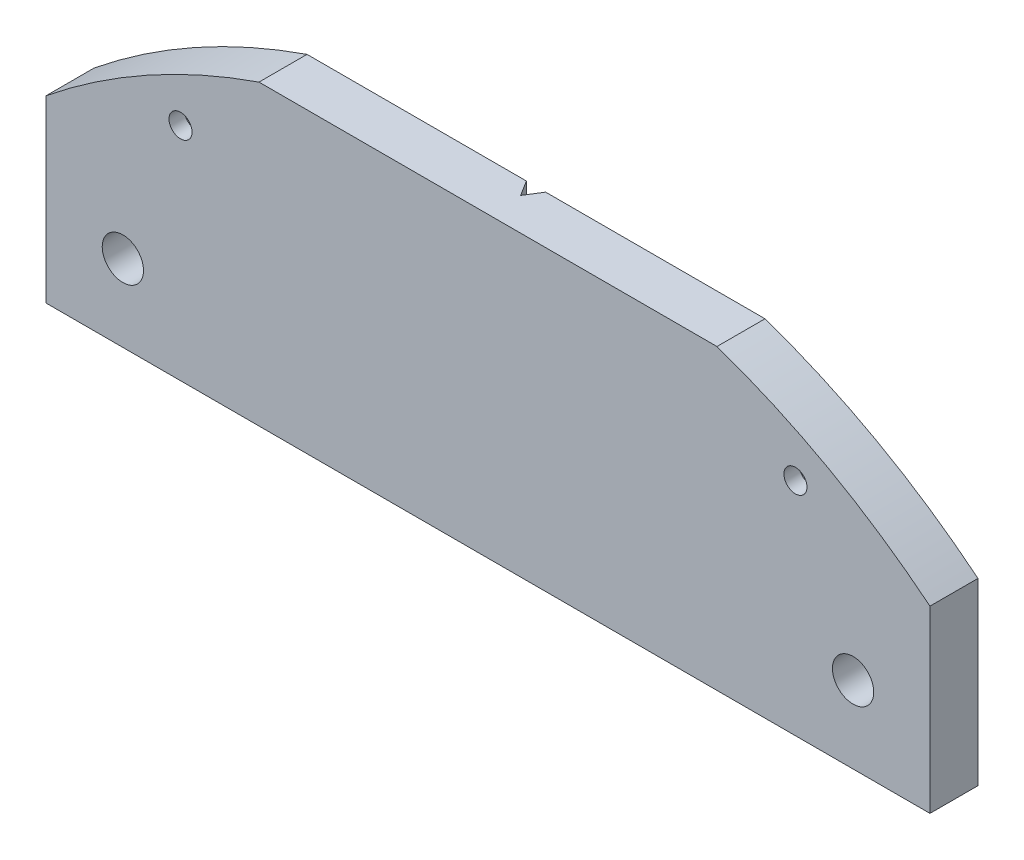
ISO-10303-21;
HEADER;
FILE_DESCRIPTION(('STEP AP214'),'2;1');
FILE_NAME('part.step','',(''),(''),'','','');
FILE_SCHEMA(('AUTOMOTIVE_DESIGN { 1 0 10303 214 1 1 1 1 }'));
ENDSEC;
DATA;
#1=APPLICATION_CONTEXT('core data for automotive mechanical design processes');
#2=APPLICATION_PROTOCOL_DEFINITION('international standard','automotive_design',2000,#1);
#3=PRODUCT_CONTEXT('',#1,'mechanical');
#4=PRODUCT('Part','Part','',(#3));
#5=PRODUCT_RELATED_PRODUCT_CATEGORY('part','',(#4));
#6=PRODUCT_DEFINITION_FORMATION('','',#4);
#7=PRODUCT_DEFINITION_CONTEXT('part definition',#1,'design');
#8=PRODUCT_DEFINITION('design','',#6,#7);
#9=PRODUCT_DEFINITION_SHAPE('','',#8);
#10=(LENGTH_UNIT() NAMED_UNIT(*) SI_UNIT(.MILLI.,.METRE.));
#11=(NAMED_UNIT(*) PLANE_ANGLE_UNIT() SI_UNIT($,.RADIAN.));
#12=(NAMED_UNIT(*) SI_UNIT($,.STERADIAN.) SOLID_ANGLE_UNIT());
#13=UNCERTAINTY_MEASURE_WITH_UNIT(LENGTH_MEASURE(1.E-05),#10,'distance_accuracy_value','');
#14=(GEOMETRIC_REPRESENTATION_CONTEXT(3) GLOBAL_UNCERTAINTY_ASSIGNED_CONTEXT((#13)) GLOBAL_UNIT_ASSIGNED_CONTEXT((#10,
#11,#12)) REPRESENTATION_CONTEXT('',''));
#15=CARTESIAN_POINT('',(0.,0.,0.));
#16=DIRECTION('',(0.,0.,1.));
#17=DIRECTION('',(1.,0.,0.));
#18=AXIS2_PLACEMENT_3D('',#15,#16,#17);
#19=CARTESIAN_POINT('',(32.,7.50000000000001,0.));
#20=DIRECTION('',(0.,0.,1.));
#21=DIRECTION('',(1.,0.,0.));
#22=AXIS2_PLACEMENT_3D('',#19,#20,#21);
#23=CYLINDRICAL_SURFACE('',#22,1.2);
#24=CARTESIAN_POINT('',(32.,7.50000000000001,5.));
#25=DIRECTION('',(0.,0.,1.));
#26=DIRECTION('',(1.,0.,0.));
#27=AXIS2_PLACEMENT_3D('',#24,#25,#26);
#28=CIRCLE('',#27,1.2);
#29=CARTESIAN_POINT('',(33.2,7.50000000000001,5.));
#30=VERTEX_POINT('',#29);
#31=EDGE_CURVE('E152',#30,#30,#28,.T.);
#32=ORIENTED_EDGE('',*,*,#31,.T.);
#33=EDGE_LOOP('',(#32));
#34=FACE_BOUND('',#33,.T.);
#35=CARTESIAN_POINT('',(32.,7.50000000000001,3.4));
#36=DIRECTION('',(0.,0.,-1.));
#37=DIRECTION('',(-1.,0.,0.));
#38=AXIS2_PLACEMENT_3D('',#35,#36,#37);
#39=CIRCLE('',#38,1.2);
#40=CARTESIAN_POINT('',(30.8,7.50000000000001,3.4));
#41=VERTEX_POINT('',#40);
#42=EDGE_CURVE('E43',#41,#41,#39,.F.);
#43=ORIENTED_EDGE('',*,*,#42,.F.);
#44=EDGE_LOOP('',(#43));
#45=FACE_BOUND('',#44,.T.);
#46=ADVANCED_FACE('F39',(#34,#45),#23,.F.);
#47=CARTESIAN_POINT('',(-32.,7.50000000000001,0.));
#48=DIRECTION('',(0.,0.,1.));
#49=DIRECTION('',(1.,0.,0.));
#50=AXIS2_PLACEMENT_3D('',#47,#48,#49);
#51=CYLINDRICAL_SURFACE('',#50,1.2);
#52=CARTESIAN_POINT('',(-32.,7.50000000000001,5.));
#53=DIRECTION('',(0.,0.,1.));
#54=DIRECTION('',(1.,0.,0.));
#55=AXIS2_PLACEMENT_3D('',#52,#53,#54);
#56=CIRCLE('',#55,1.2);
#57=CARTESIAN_POINT('',(-30.8,7.50000000000001,5.));
#58=VERTEX_POINT('',#57);
#59=EDGE_CURVE('E167',#58,#58,#56,.T.);
#60=ORIENTED_EDGE('',*,*,#59,.T.);
#61=EDGE_LOOP('',(#60));
#62=FACE_BOUND('',#61,.T.);
#63=CARTESIAN_POINT('',(-32.,7.50000000000001,3.4));
#64=DIRECTION('',(0.,0.,-1.));
#65=DIRECTION('',(-1.,0.,0.));
#66=AXIS2_PLACEMENT_3D('',#63,#64,#65);
#67=CIRCLE('',#66,1.2);
#68=CARTESIAN_POINT('',(-33.2,7.50000000000001,3.4));
#69=VERTEX_POINT('',#68);
#70=EDGE_CURVE('E146',#69,#69,#67,.F.);
#71=ORIENTED_EDGE('',*,*,#70,.F.);
#72=EDGE_LOOP('',(#71));
#73=FACE_BOUND('',#72,.T.);
#74=ADVANCED_FACE('F260',(#62,#73),#51,.F.);
#75=CARTESIAN_POINT('',(0.,0.,0.));
#76=DIRECTION('',(0.,0.,1.));
#77=DIRECTION('',(1.,0.,0.));
#78=AXIS2_PLACEMENT_3D('',#75,#76,#77);
#79=PLANE('',#78);
#80=CARTESIAN_POINT('',(-32.,7.50000000000001,0.));
#81=DIRECTION('',(0.,0.,-1.));
#82=DIRECTION('',(-1.,0.,0.));
#83=AXIS2_PLACEMENT_3D('',#80,#81,#82);
#84=CIRCLE('',#83,2.1);
#85=CARTESIAN_POINT('',(-34.1,7.50000000000001,0.));
#86=VERTEX_POINT('',#85);
#87=EDGE_CURVE('E159',#86,#86,#84,.T.);
#88=ORIENTED_EDGE('',*,*,#87,.F.);
#89=EDGE_LOOP('',(#88));
#90=FACE_BOUND('',#89,.T.);
#91=CARTESIAN_POINT('',(-38.,-7.49999999999999,0.));
#92=DIRECTION('',(0.,0.,1.));
#93=DIRECTION('',(-1.,0.,0.));
#94=AXIS2_PLACEMENT_3D('',#91,#92,#93);
#95=CIRCLE('',#94,2.15);
#96=CARTESIAN_POINT('',(-40.15,-7.49999999999999,0.));
#97=VERTEX_POINT('',#96);
#98=EDGE_CURVE('E185',#97,#97,#95,.T.);
#99=ORIENTED_EDGE('',*,*,#98,.T.);
#100=EDGE_LOOP('',(#99));
#101=FACE_BOUND('',#100,.T.);
#102=DIRECTION('',(-1.,0.,0.));
#103=VECTOR('',#102,1.);
#104=CARTESIAN_POINT('',(-46.,15.5,0.));
#105=LINE('',#104,#103);
#106=CARTESIAN_POINT('',(-1.,15.5,0.));
#107=VERTEX_POINT('',#106);
#108=CARTESIAN_POINT('',(-23.832750575626,15.5,0.));
#109=VERTEX_POINT('',#108);
#110=EDGE_CURVE('E61',#107,#109,#105,.T.);
#111=ORIENTED_EDGE('',*,*,#110,.F.);
#112=DIRECTION('',(0.,-1.,0.));
#113=VECTOR('',#112,1.);
#114=CARTESIAN_POINT('',(-1.,15.5,0.));
#115=LINE('',#114,#113);
#116=CARTESIAN_POINT('',(-1.,-15.5,0.));
#117=VERTEX_POINT('',#116);
#118=EDGE_CURVE('E177',#107,#117,#115,.T.);
#119=ORIENTED_EDGE('',*,*,#118,.T.);
#120=DIRECTION('',(1.,0.,0.));
#121=VECTOR('',#120,1.);
#122=CARTESIAN_POINT('',(-46.,-15.5,0.));
#123=LINE('',#122,#121);
#124=CARTESIAN_POINT('',(-46.,-15.5,0.));
#125=VERTEX_POINT('',#124);
#126=EDGE_CURVE('E136',#125,#117,#123,.T.);
#127=ORIENTED_EDGE('',*,*,#126,.F.);
#128=DIRECTION('',(0.,-1.,0.));
#129=VECTOR('',#128,1.);
#130=CARTESIAN_POINT('',(-46.,15.5,0.));
#131=LINE('',#130,#129);
#132=CARTESIAN_POINT('',(-46.,3.18333088307355,0.));
#133=VERTEX_POINT('',#132);
#134=EDGE_CURVE('E131',#133,#125,#131,.T.);
#135=ORIENTED_EDGE('',*,*,#134,.F.);
#136=CARTESIAN_POINT('',(0.,-53.5,0.));
#137=DIRECTION('',(0.,0.,1.));
#138=DIRECTION('',(1.,0.,0.));
#139=AXIS2_PLACEMENT_3D('',#136,#137,#138);
#140=CIRCLE('',#139,73.);
#141=EDGE_CURVE('E11',#109,#133,#140,.T.);
#142=ORIENTED_EDGE('',*,*,#141,.F.);
#143=EDGE_LOOP('',(#111,#119,#127,#135,#142));
#144=FACE_BOUND('',#143,.T.);
#145=ADVANCED_FACE('F232',(#90,#101,#144),#79,.F.);
#146=CARTESIAN_POINT('',(46.,15.5,5.));
#147=DIRECTION('',(-1.,0.,0.));
#148=DIRECTION('',(0.,0.,1.));
#149=AXIS2_PLACEMENT_3D('',#146,#147,#148);
#150=PLANE('',#149);
#151=DIRECTION('',(0.,0.,1.));
#152=VECTOR('',#151,1.);
#153=CARTESIAN_POINT('',(46.,3.18333088307357,0.));
#154=LINE('',#153,#152);
#155=CARTESIAN_POINT('',(46.,3.18333088307357,5.));
#156=VERTEX_POINT('',#155);
#157=CARTESIAN_POINT('',(46.,3.18333088307357,0.));
#158=VERTEX_POINT('',#157);
#159=EDGE_CURVE('E207',#156,#158,#154,.F.);
#160=ORIENTED_EDGE('',*,*,#159,.F.);
#161=DIRECTION('',(0.,1.,0.));
#162=VECTOR('',#161,1.);
#163=CARTESIAN_POINT('',(46.,15.5,5.));
#164=LINE('',#163,#162);
#165=CARTESIAN_POINT('',(46.,-15.5,5.));
#166=VERTEX_POINT('',#165);
#167=EDGE_CURVE('E141',#166,#156,#164,.T.);
#168=ORIENTED_EDGE('',*,*,#167,.F.);
#169=DIRECTION('',(0.,0.,-1.));
#170=VECTOR('',#169,1.);
#171=CARTESIAN_POINT('',(46.,-15.5,5.));
#172=LINE('',#171,#170);
#173=CARTESIAN_POINT('',(46.,-15.5,0.));
#174=VERTEX_POINT('',#173);
#175=EDGE_CURVE('E144',#166,#174,#172,.T.);
#176=ORIENTED_EDGE('',*,*,#175,.T.);
#177=DIRECTION('',(0.,1.,0.));
#178=VECTOR('',#177,1.);
#179=CARTESIAN_POINT('',(46.,15.5,0.));
#180=LINE('',#179,#178);
#181=EDGE_CURVE('E138',#174,#158,#180,.T.);
#182=ORIENTED_EDGE('',*,*,#181,.T.);
#183=EDGE_LOOP('',(#160,#168,#176,#182));
#184=FACE_BOUND('',#183,.T.);
#185=ADVANCED_FACE('F41',(#184),#150,.F.);
#186=CARTESIAN_POINT('',(-46.,15.5,5.));
#187=DIRECTION('',(0.,-1.,0.));
#188=DIRECTION('',(0.,0.,-1.));
#189=AXIS2_PLACEMENT_3D('',#186,#187,#188);
#190=PLANE('',#189);
#191=DIRECTION('',(-0.52999894000318,0.,0.847998304005088));
#192=VECTOR('',#191,1.);
#193=CARTESIAN_POINT('',(0.,15.5,1.6));
#194=LINE('',#193,#192);
#195=CARTESIAN_POINT('',(1.,15.5,0.));
#196=VERTEX_POINT('',#195);
#197=CARTESIAN_POINT('',(0.,15.5,1.6));
#198=VERTEX_POINT('',#197);
#199=EDGE_CURVE('E115',#196,#198,#194,.T.);
#200=ORIENTED_EDGE('',*,*,#199,.T.);
#201=DIRECTION('',(-0.52999894000318,0.,-0.847998304005088));
#202=VECTOR('',#201,1.);
#203=CARTESIAN_POINT('',(-1.,15.5,0.));
#204=LINE('',#203,#202);
#205=EDGE_CURVE('E120',#198,#107,#204,.T.);
#206=ORIENTED_EDGE('',*,*,#205,.T.);
#207=ORIENTED_EDGE('',*,*,#110,.T.);
#208=DIRECTION('',(0.,0.,1.));
#209=VECTOR('',#208,1.);
#210=CARTESIAN_POINT('',(-23.832750575626,15.5,0.));
#211=LINE('',#210,#209);
#212=CARTESIAN_POINT('',(-23.832750575626,15.5,5.));
#213=VERTEX_POINT('',#212);
#214=EDGE_CURVE('E202',#213,#109,#211,.F.);
#215=ORIENTED_EDGE('',*,*,#214,.F.);
#216=DIRECTION('',(-1.,0.,0.));
#217=VECTOR('',#216,1.);
#218=CARTESIAN_POINT('',(-46.,15.5,5.));
#219=LINE('',#218,#217);
#220=CARTESIAN_POINT('',(23.832750575626,15.5,5.));
#221=VERTEX_POINT('',#220);
#222=EDGE_CURVE('E208',#221,#213,#219,.T.);
#223=ORIENTED_EDGE('',*,*,#222,.F.);
#224=DIRECTION('',(0.,0.,1.));
#225=VECTOR('',#224,1.);
#226=CARTESIAN_POINT('',(23.832750575626,15.5,0.));
#227=LINE('',#226,#225);
#228=CARTESIAN_POINT('',(23.832750575626,15.5,0.));
#229=VERTEX_POINT('',#228);
#230=EDGE_CURVE('E135',#229,#221,#227,.T.);
#231=ORIENTED_EDGE('',*,*,#230,.F.);
#232=EDGE_CURVE('E123',#229,#196,#105,.T.);
#233=ORIENTED_EDGE('',*,*,#232,.T.);
#234=EDGE_LOOP('',(#200,#206,#207,#215,#223,#231,#233));
#235=FACE_BOUND('',#234,.T.);
#236=ADVANCED_FACE('F128',(#235),#190,.F.);
#237=CARTESIAN_POINT('',(-46.,15.5,5.));
#238=DIRECTION('',(1.,0.,0.));
#239=DIRECTION('',(0.,0.,-1.));
#240=AXIS2_PLACEMENT_3D('',#237,#238,#239);
#241=PLANE('',#240);
#242=DIRECTION('',(0.,0.,1.));
#243=VECTOR('',#242,1.);
#244=CARTESIAN_POINT('',(-46.,3.18333088307355,0.));
#245=LINE('',#244,#243);
#246=CARTESIAN_POINT('',(-46.,3.18333088307355,5.));
#247=VERTEX_POINT('',#246);
#248=EDGE_CURVE('E196',#133,#247,#245,.T.);
#249=ORIENTED_EDGE('',*,*,#248,.F.);
#250=ORIENTED_EDGE('',*,*,#134,.T.);
#251=DIRECTION('',(0.,0.,-1.));
#252=VECTOR('',#251,1.);
#253=CARTESIAN_POINT('',(-46.,-15.5,5.));
#254=LINE('',#253,#252);
#255=CARTESIAN_POINT('',(-46.,-15.5,5.));
#256=VERTEX_POINT('',#255);
#257=EDGE_CURVE('E48',#256,#125,#254,.T.);
#258=ORIENTED_EDGE('',*,*,#257,.F.);
#259=DIRECTION('',(0.,-1.,0.));
#260=VECTOR('',#259,1.);
#261=CARTESIAN_POINT('',(-46.,15.5,5.));
#262=LINE('',#261,#260);
#263=EDGE_CURVE('E214',#247,#256,#262,.T.);
#264=ORIENTED_EDGE('',*,*,#263,.F.);
#265=EDGE_LOOP('',(#249,#250,#258,#264));
#266=FACE_BOUND('',#265,.T.);
#267=ADVANCED_FACE('F238',(#266),#241,.F.);
#268=CARTESIAN_POINT('',(0.,0.,5.));
#269=DIRECTION('',(0.,0.,1.));
#270=DIRECTION('',(1.,0.,0.));
#271=AXIS2_PLACEMENT_3D('',#268,#269,#270);
#272=PLANE('',#271);
#273=ORIENTED_EDGE('',*,*,#59,.F.);
#274=EDGE_LOOP('',(#273));
#275=FACE_BOUND('',#274,.T.);
#276=ORIENTED_EDGE('',*,*,#31,.F.);
#277=EDGE_LOOP('',(#276));
#278=FACE_BOUND('',#277,.T.);
#279=CARTESIAN_POINT('',(38.,-7.49999999999999,5.));
#280=DIRECTION('',(0.,0.,1.));
#281=DIRECTION('',(1.,0.,0.));
#282=AXIS2_PLACEMENT_3D('',#279,#280,#281);
#283=CIRCLE('',#282,2.15);
#284=CARTESIAN_POINT('',(40.15,-7.49999999999999,5.));
#285=VERTEX_POINT('',#284);
#286=EDGE_CURVE('E189',#285,#285,#283,.T.);
#287=ORIENTED_EDGE('',*,*,#286,.F.);
#288=EDGE_LOOP('',(#287));
#289=FACE_BOUND('',#288,.T.);
#290=CARTESIAN_POINT('',(-38.,-7.49999999999999,5.));
#291=DIRECTION('',(0.,0.,1.));
#292=DIRECTION('',(-1.,0.,0.));
#293=AXIS2_PLACEMENT_3D('',#290,#291,#292);
#294=CIRCLE('',#293,2.15);
#295=CARTESIAN_POINT('',(-40.15,-7.49999999999999,5.));
#296=VERTEX_POINT('',#295);
#297=EDGE_CURVE('E192',#296,#296,#294,.T.);
#298=ORIENTED_EDGE('',*,*,#297,.F.);
#299=EDGE_LOOP('',(#298));
#300=FACE_BOUND('',#299,.T.);
#301=ORIENTED_EDGE('',*,*,#167,.T.);
#302=CARTESIAN_POINT('',(0.,-53.5,5.));
#303=DIRECTION('',(0.,0.,1.));
#304=DIRECTION('',(1.,0.,0.));
#305=AXIS2_PLACEMENT_3D('',#302,#303,#304);
#306=CIRCLE('',#305,73.);
#307=EDGE_CURVE('E199',#156,#221,#306,.T.);
#308=ORIENTED_EDGE('',*,*,#307,.T.);
#309=ORIENTED_EDGE('',*,*,#222,.T.);
#310=EDGE_CURVE('E190',#213,#247,#306,.T.);
#311=ORIENTED_EDGE('',*,*,#310,.T.);
#312=ORIENTED_EDGE('',*,*,#263,.T.);
#313=DIRECTION('',(1.,0.,0.));
#314=VECTOR('',#313,1.);
#315=CARTESIAN_POINT('',(-46.,-15.5,5.));
#316=LINE('',#315,#314);
#317=EDGE_CURVE('E150',#256,#166,#316,.T.);
#318=ORIENTED_EDGE('',*,*,#317,.T.);
#319=EDGE_LOOP('',(#301,#308,#309,#311,#312,#318));
#320=FACE_BOUND('',#319,.T.);
#321=ADVANCED_FACE('F220',(#275,#278,#289,#300,#320),#272,.T.);
#322=CARTESIAN_POINT('',(32.,7.50000000000001,0.));
#323=DIRECTION('',(0.,0.,-1.));
#324=DIRECTION('',(-1.,0.,0.));
#325=AXIS2_PLACEMENT_3D('',#322,#323,#324);
#326=CIRCLE('',#325,2.1);
#327=CARTESIAN_POINT('',(29.9,7.50000000000001,0.));
#328=VERTEX_POINT('',#327);
#329=EDGE_CURVE('E162',#328,#328,#326,.T.);
#330=ORIENTED_EDGE('',*,*,#329,.F.);
#331=EDGE_LOOP('',(#330));
#332=FACE_BOUND('',#331,.T.);
#333=CARTESIAN_POINT('',(38.,-7.49999999999999,0.));
#334=DIRECTION('',(0.,0.,1.));
#335=DIRECTION('',(1.,0.,0.));
#336=AXIS2_PLACEMENT_3D('',#333,#334,#335);
#337=CIRCLE('',#336,2.15);
#338=CARTESIAN_POINT('',(40.15,-7.49999999999999,0.));
#339=VERTEX_POINT('',#338);
#340=EDGE_CURVE('E183',#339,#339,#337,.T.);
#341=ORIENTED_EDGE('',*,*,#340,.T.);
#342=EDGE_LOOP('',(#341));
#343=FACE_BOUND('',#342,.T.);
#344=CARTESIAN_POINT('',(1.,-15.5,0.));
#345=VERTEX_POINT('',#344);
#346=EDGE_CURVE('E130',#345,#174,#123,.T.);
#347=ORIENTED_EDGE('',*,*,#346,.F.);
#348=DIRECTION('',(0.,-1.,0.));
#349=VECTOR('',#348,1.);
#350=CARTESIAN_POINT('',(1.,15.5,0.));
#351=LINE('',#350,#349);
#352=EDGE_CURVE('E57',#196,#345,#351,.T.);
#353=ORIENTED_EDGE('',*,*,#352,.F.);
#354=ORIENTED_EDGE('',*,*,#232,.F.);
#355=CARTESIAN_POINT('',(0.,-53.5,0.));
#356=DIRECTION('',(0.,0.,1.));
#357=DIRECTION('',(1.,0.,0.));
#358=AXIS2_PLACEMENT_3D('',#355,#356,#357);
#359=CIRCLE('',#358,73.);
#360=EDGE_CURVE('E198',#158,#229,#359,.T.);
#361=ORIENTED_EDGE('',*,*,#360,.F.);
#362=ORIENTED_EDGE('',*,*,#181,.F.);
#363=EDGE_LOOP('',(#347,#353,#354,#361,#362));
#364=FACE_BOUND('',#363,.T.);
#365=ADVANCED_FACE('F124',(#332,#343,#364),#79,.F.);
#366=CARTESIAN_POINT('',(-46.,-15.5,5.));
#367=DIRECTION('',(0.,1.,0.));
#368=DIRECTION('',(0.,0.,1.));
#369=AXIS2_PLACEMENT_3D('',#366,#367,#368);
#370=PLANE('',#369);
#371=ORIENTED_EDGE('',*,*,#126,.T.);
#372=DIRECTION('',(-0.52999894000318,0.,-0.847998304005088));
#373=VECTOR('',#372,1.);
#374=CARTESIAN_POINT('',(-1.,-15.5,0.));
#375=LINE('',#374,#373);
#376=CARTESIAN_POINT('',(0.,-15.5,1.6));
#377=VERTEX_POINT('',#376);
#378=EDGE_CURVE('E117',#377,#117,#375,.T.);
#379=ORIENTED_EDGE('',*,*,#378,.F.);
#380=DIRECTION('',(-0.52999894000318,0.,0.847998304005088));
#381=VECTOR('',#380,1.);
#382=CARTESIAN_POINT('',(0.,-15.5,1.6));
#383=LINE('',#382,#381);
#384=EDGE_CURVE('E173',#345,#377,#383,.T.);
#385=ORIENTED_EDGE('',*,*,#384,.F.);
#386=ORIENTED_EDGE('',*,*,#346,.T.);
#387=ORIENTED_EDGE('',*,*,#175,.F.);
#388=ORIENTED_EDGE('',*,*,#317,.F.);
#389=ORIENTED_EDGE('',*,*,#257,.T.);
#390=EDGE_LOOP('',(#371,#379,#385,#386,#387,#388,#389));
#391=FACE_BOUND('',#390,.T.);
#392=ADVANCED_FACE('F222',(#391),#370,.F.);
#393=CARTESIAN_POINT('',(0.,-53.5,0.));
#394=DIRECTION('',(0.,0.,1.));
#395=DIRECTION('',(1.,0.,0.));
#396=AXIS2_PLACEMENT_3D('',#393,#394,#395);
#397=CYLINDRICAL_SURFACE('',#396,73.);
#398=ORIENTED_EDGE('',*,*,#214,.T.);
#399=ORIENTED_EDGE('',*,*,#141,.T.);
#400=ORIENTED_EDGE('',*,*,#248,.T.);
#401=ORIENTED_EDGE('',*,*,#310,.F.);
#402=EDGE_LOOP('',(#398,#399,#400,#401));
#403=FACE_BOUND('',#402,.T.);
#404=ADVANCED_FACE('F233',(#403),#397,.T.);
#405=ORIENTED_EDGE('',*,*,#159,.T.);
#406=ORIENTED_EDGE('',*,*,#360,.T.);
#407=ORIENTED_EDGE('',*,*,#230,.T.);
#408=ORIENTED_EDGE('',*,*,#307,.F.);
#409=EDGE_LOOP('',(#405,#406,#407,#408));
#410=FACE_BOUND('',#409,.T.);
#411=ADVANCED_FACE('F226',(#410),#397,.T.);
#412=CARTESIAN_POINT('',(-38.,-7.49999999999999,0.));
#413=DIRECTION('',(0.,0.,1.));
#414=DIRECTION('',(1.,0.,0.));
#415=AXIS2_PLACEMENT_3D('',#412,#413,#414);
#416=CYLINDRICAL_SURFACE('',#415,2.15);
#417=ORIENTED_EDGE('',*,*,#98,.F.);
#418=EDGE_LOOP('',(#417));
#419=FACE_BOUND('',#418,.T.);
#420=ORIENTED_EDGE('',*,*,#297,.T.);
#421=EDGE_LOOP('',(#420));
#422=FACE_BOUND('',#421,.T.);
#423=ADVANCED_FACE('F255',(#419,#422),#416,.F.);
#424=CARTESIAN_POINT('',(38.,-7.49999999999999,0.));
#425=DIRECTION('',(0.,0.,1.));
#426=DIRECTION('',(1.,0.,0.));
#427=AXIS2_PLACEMENT_3D('',#424,#425,#426);
#428=CYLINDRICAL_SURFACE('',#427,2.15);
#429=ORIENTED_EDGE('',*,*,#340,.F.);
#430=EDGE_LOOP('',(#429));
#431=FACE_BOUND('',#430,.T.);
#432=ORIENTED_EDGE('',*,*,#286,.T.);
#433=EDGE_LOOP('',(#432));
#434=FACE_BOUND('',#433,.T.);
#435=ADVANCED_FACE('F243',(#431,#434),#428,.F.);
#436=CARTESIAN_POINT('',(-1.,15.5,0.));
#437=DIRECTION('',(-0.847998304005088,0.,0.52999894000318));
#438=DIRECTION('',(0.52999894000318,0.,0.847998304005088));
#439=AXIS2_PLACEMENT_3D('',#436,#437,#438);
#440=PLANE('',#439);
#441=ORIENTED_EDGE('',*,*,#378,.T.);
#442=ORIENTED_EDGE('',*,*,#118,.F.);
#443=ORIENTED_EDGE('',*,*,#205,.F.);
#444=DIRECTION('',(0.,-1.,0.));
#445=VECTOR('',#444,1.);
#446=CARTESIAN_POINT('',(0.,15.5,1.6));
#447=LINE('',#446,#445);
#448=EDGE_CURVE('E112',#198,#377,#447,.T.);
#449=ORIENTED_EDGE('',*,*,#448,.T.);
#450=EDGE_LOOP('',(#441,#442,#443,#449));
#451=FACE_BOUND('',#450,.T.);
#452=ADVANCED_FACE('F241',(#451),#440,.F.);
#453=CARTESIAN_POINT('',(0.,15.5,1.6));
#454=DIRECTION('',(0.847998304005088,0.,0.52999894000318));
#455=DIRECTION('',(0.52999894000318,0.,-0.847998304005088));
#456=AXIS2_PLACEMENT_3D('',#453,#454,#455);
#457=PLANE('',#456);
#458=ORIENTED_EDGE('',*,*,#384,.T.);
#459=ORIENTED_EDGE('',*,*,#448,.F.);
#460=ORIENTED_EDGE('',*,*,#199,.F.);
#461=ORIENTED_EDGE('',*,*,#352,.T.);
#462=EDGE_LOOP('',(#458,#459,#460,#461));
#463=FACE_BOUND('',#462,.T.);
#464=ADVANCED_FACE('F113',(#463),#457,.F.);
#465=CARTESIAN_POINT('',(-32.,7.50000000000001,3.4));
#466=DIRECTION('',(0.,0.,-1.));
#467=DIRECTION('',(-1.,0.,0.));
#468=AXIS2_PLACEMENT_3D('',#465,#466,#467);
#469=PLANE('',#468);
#470=CARTESIAN_POINT('',(-32.,7.50000000000001,3.4));
#471=DIRECTION('',(0.,0.,-1.));
#472=DIRECTION('',(-1.,0.,0.));
#473=AXIS2_PLACEMENT_3D('',#470,#471,#472);
#474=CIRCLE('',#473,2.1);
#475=CARTESIAN_POINT('',(-34.1,7.50000000000001,3.4));
#476=VERTEX_POINT('',#475);
#477=EDGE_CURVE('E153',#476,#476,#474,.T.);
#478=ORIENTED_EDGE('',*,*,#477,.T.);
#479=EDGE_LOOP('',(#478));
#480=FACE_BOUND('',#479,.T.);
#481=ORIENTED_EDGE('',*,*,#70,.T.);
#482=EDGE_LOOP('',(#481));
#483=FACE_BOUND('',#482,.T.);
#484=ADVANCED_FACE('F248',(#480,#483),#469,.T.);
#485=CARTESIAN_POINT('',(-32.,7.50000000000001,3.4));
#486=DIRECTION('',(0.,0.,-1.));
#487=DIRECTION('',(-1.,0.,0.));
#488=AXIS2_PLACEMENT_3D('',#485,#486,#487);
#489=CYLINDRICAL_SURFACE('',#488,2.1);
#490=ORIENTED_EDGE('',*,*,#477,.F.);
#491=EDGE_LOOP('',(#490));
#492=FACE_BOUND('',#491,.T.);
#493=ORIENTED_EDGE('',*,*,#87,.T.);
#494=EDGE_LOOP('',(#493));
#495=FACE_BOUND('',#494,.T.);
#496=ADVANCED_FACE('F272',(#492,#495),#489,.F.);
#497=CARTESIAN_POINT('',(32.,7.50000000000001,3.4));
#498=DIRECTION('',(0.,0.,-1.));
#499=DIRECTION('',(-1.,0.,0.));
#500=AXIS2_PLACEMENT_3D('',#497,#498,#499);
#501=PLANE('',#500);
#502=CARTESIAN_POINT('',(32.,7.50000000000001,3.4));
#503=DIRECTION('',(0.,0.,-1.));
#504=DIRECTION('',(-1.,0.,0.));
#505=AXIS2_PLACEMENT_3D('',#502,#503,#504);
#506=CIRCLE('',#505,2.1);
#507=CARTESIAN_POINT('',(29.9,7.50000000000001,3.4));
#508=VERTEX_POINT('',#507);
#509=EDGE_CURVE('E170',#508,#508,#506,.T.);
#510=ORIENTED_EDGE('',*,*,#509,.T.);
#511=EDGE_LOOP('',(#510));
#512=FACE_BOUND('',#511,.T.);
#513=ORIENTED_EDGE('',*,*,#42,.T.);
#514=EDGE_LOOP('',(#513));
#515=FACE_BOUND('',#514,.T.);
#516=ADVANCED_FACE('F269',(#512,#515),#501,.T.);
#517=CARTESIAN_POINT('',(32.,7.50000000000001,3.4));
#518=DIRECTION('',(0.,0.,-1.));
#519=DIRECTION('',(-1.,0.,0.));
#520=AXIS2_PLACEMENT_3D('',#517,#518,#519);
#521=CYLINDRICAL_SURFACE('',#520,2.1);
#522=ORIENTED_EDGE('',*,*,#509,.F.);
#523=EDGE_LOOP('',(#522));
#524=FACE_BOUND('',#523,.T.);
#525=ORIENTED_EDGE('',*,*,#329,.T.);
#526=EDGE_LOOP('',(#525));
#527=FACE_BOUND('',#526,.T.);
#528=ADVANCED_FACE('F266',(#524,#527),#521,.F.);
#529=CLOSED_SHELL('',(#46,#74,#145,#185,#236,#267,#321,#365,#392,#404,#411,#423,#435,#452,#464,
#484,#496,#516,#528));
#530=MANIFOLD_SOLID_BREP('B2',#529);
#531=ADVANCED_BREP_SHAPE_REPRESENTATION('',(#18,#530),#14);
#532=SHAPE_DEFINITION_REPRESENTATION(#9,#531);
ENDSEC;
END-ISO-10303-21;
